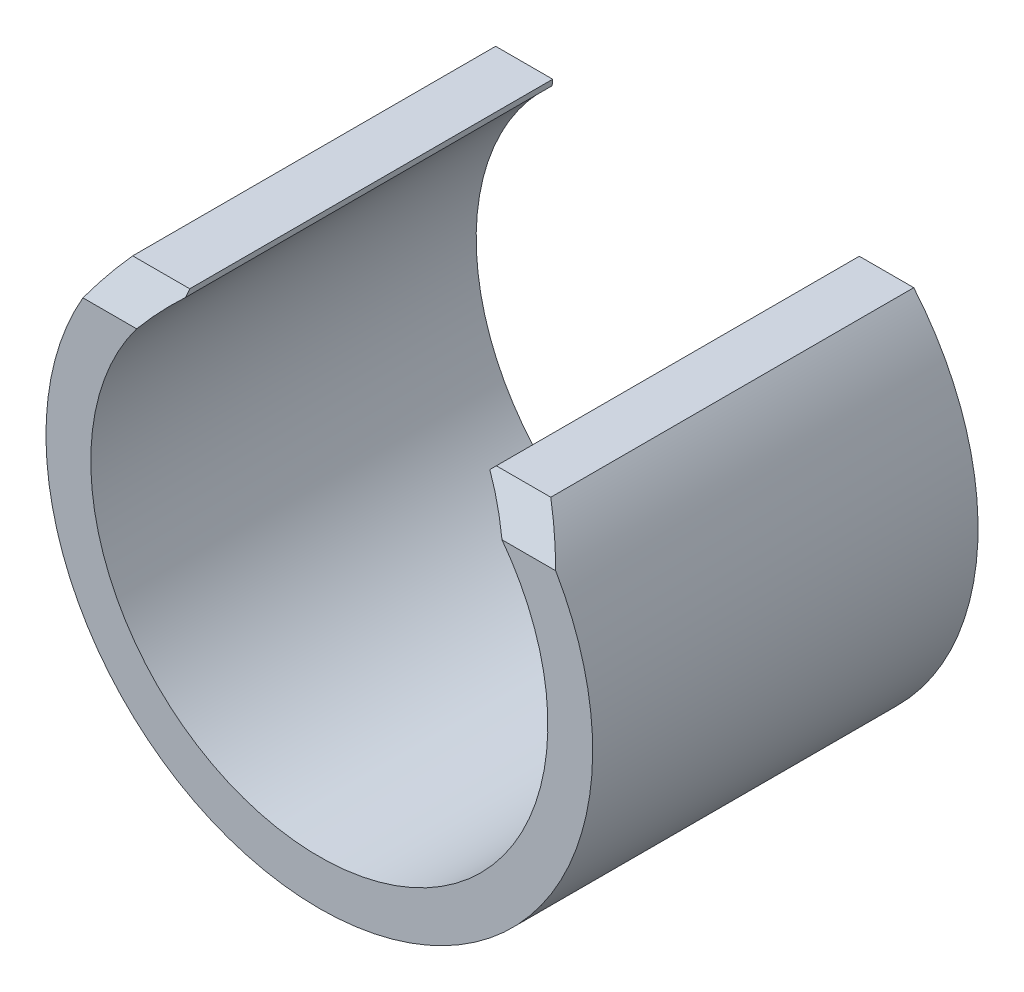
ISO-10303-21;
HEADER;
FILE_DESCRIPTION(('STEP AP214'),'2;1');
FILE_NAME('part.step','',(''),(''),'','','');
FILE_SCHEMA(('AUTOMOTIVE_DESIGN { 1 0 10303 214 1 1 1 1 }'));
ENDSEC;
DATA;
#1=APPLICATION_CONTEXT('core data for automotive mechanical design processes');
#2=APPLICATION_PROTOCOL_DEFINITION('international standard','automotive_design',2000,#1);
#3=PRODUCT_CONTEXT('',#1,'mechanical');
#4=PRODUCT('Part','Part','',(#3));
#5=PRODUCT_RELATED_PRODUCT_CATEGORY('part','',(#4));
#6=PRODUCT_DEFINITION_FORMATION('','',#4);
#7=PRODUCT_DEFINITION_CONTEXT('part definition',#1,'design');
#8=PRODUCT_DEFINITION('design','',#6,#7);
#9=PRODUCT_DEFINITION_SHAPE('','',#8);
#10=(LENGTH_UNIT() NAMED_UNIT(*) SI_UNIT(.MILLI.,.METRE.));
#11=(NAMED_UNIT(*) PLANE_ANGLE_UNIT() SI_UNIT($,.RADIAN.));
#12=(NAMED_UNIT(*) SI_UNIT($,.STERADIAN.) SOLID_ANGLE_UNIT());
#13=UNCERTAINTY_MEASURE_WITH_UNIT(LENGTH_MEASURE(1.E-05),#10,'distance_accuracy_value','');
#14=(GEOMETRIC_REPRESENTATION_CONTEXT(3) GLOBAL_UNCERTAINTY_ASSIGNED_CONTEXT((#13)) GLOBAL_UNIT_ASSIGNED_CONTEXT((#10,
#11,#12)) REPRESENTATION_CONTEXT('',''));
#15=CARTESIAN_POINT('',(0.,0.,0.));
#16=DIRECTION('',(0.,0.,1.));
#17=DIRECTION('',(1.,0.,0.));
#18=AXIS2_PLACEMENT_3D('',#15,#16,#17);
#19=CARTESIAN_POINT('',(-132.090361963931,-120.590013889798,8.6));
#20=DIRECTION('',(0.,0.,-1.));
#21=DIRECTION('',(-1.,0.,0.));
#22=AXIS2_PLACEMENT_3D('',#19,#20,#21);
#23=CYLINDRICAL_SURFACE('',#22,6.1);
#24=DIRECTION('',(0.,0.,-1.));
#25=VECTOR('',#24,1.);
#26=CARTESIAN_POINT('',(-127.425332489212,-116.659683114914,8.6));
#27=LINE('',#26,#25);
#28=CARTESIAN_POINT('',(-127.425332489212,-116.659683114914,8.09999999999999));
#29=VERTEX_POINT('',#28);
#30=CARTESIAN_POINT('',(-127.425332489212,-116.659683114914,0.));
#31=VERTEX_POINT('',#30);
#32=EDGE_CURVE('E100',#29,#31,#27,.T.);
#33=ORIENTED_EDGE('',*,*,#32,.F.);
#34=CARTESIAN_POINT('',(-132.090361963931,-120.590013889798,10.3691775308835));
#35=DIRECTION('',(0.,0.500000000000004,0.866025403784436));
#36=DIRECTION('',(0.,0.866025403784436,-0.500000000000004));
#37=AXIS2_PLACEMENT_3D('',#34,#35,#36);
#38=ELLIPSE('',#37,7.04367328411346,6.1);
#39=CARTESIAN_POINT('',(-126.815892076573,-117.525708518699,8.6));
#40=VERTEX_POINT('',#39);
#41=EDGE_CURVE('E145',#29,#40,#38,.F.);
#42=ORIENTED_EDGE('',*,*,#41,.T.);
#43=CARTESIAN_POINT('',(-132.090361963931,-120.590013889798,8.6));
#44=DIRECTION('',(0.,0.,1.));
#45=DIRECTION('',(1.,0.,0.));
#46=AXIS2_PLACEMENT_3D('',#43,#44,#45);
#47=CIRCLE('',#46,6.1);
#48=CARTESIAN_POINT('',(-137.364831851289,-117.525708518699,8.6));
#49=VERTEX_POINT('',#48);
#50=EDGE_CURVE('E130',#49,#40,#47,.T.);
#51=ORIENTED_EDGE('',*,*,#50,.F.);
#52=CARTESIAN_POINT('',(-132.090361963931,-120.590013889798,10.3691775308835));
#53=DIRECTION('',(0.,0.499999999999995,0.866025403784442));
#54=DIRECTION('',(0.,0.866025403784442,-0.499999999999995));
#55=AXIS2_PLACEMENT_3D('',#52,#53,#54);
#56=ELLIPSE('',#55,7.04367328411341,6.1);
#57=CARTESIAN_POINT('',(-136.75539143865,-116.659683114914,8.09999999999999));
#58=VERTEX_POINT('',#57);
#59=EDGE_CURVE('E143',#49,#58,#56,.F.);
#60=ORIENTED_EDGE('',*,*,#59,.T.);
#61=DIRECTION('',(0.,0.,-1.));
#62=VECTOR('',#61,1.);
#63=CARTESIAN_POINT('',(-136.75539143865,-116.659683114914,8.6));
#64=LINE('',#63,#62);
#65=CARTESIAN_POINT('',(-136.75539143865,-116.659683114914,0.));
#66=VERTEX_POINT('',#65);
#67=EDGE_CURVE('E109',#58,#66,#64,.T.);
#68=ORIENTED_EDGE('',*,*,#67,.T.);
#69=CARTESIAN_POINT('',(-132.090361963931,-120.590013889798,0.));
#70=DIRECTION('',(0.,0.,1.));
#71=DIRECTION('',(1.,0.,0.));
#72=AXIS2_PLACEMENT_3D('',#69,#70,#71);
#73=CIRCLE('',#72,6.1);
#74=EDGE_CURVE('E115',#66,#31,#73,.T.);
#75=ORIENTED_EDGE('',*,*,#74,.T.);
#76=EDGE_LOOP('',(#33,#42,#51,#60,#68,#75));
#77=FACE_BOUND('',#76,.T.);
#78=ADVANCED_FACE('F36',(#77),#23,.T.);
#79=CARTESIAN_POINT('',(-128.840361963931,-116.659683114914,8.6));
#80=DIRECTION('',(0.,-1.,0.));
#81=DIRECTION('',(1.,0.,0.));
#82=AXIS2_PLACEMENT_3D('',#79,#80,#81);
#83=PLANE('',#82);
#84=DIRECTION('',(-1.,0.,0.));
#85=VECTOR('',#84,1.);
#86=CARTESIAN_POINT('',(-128.840361963931,-116.659683114914,0.));
#87=LINE('',#86,#85);
#88=CARTESIAN_POINT('',(-128.640361963931,-116.659683114914,0.));
#89=VERTEX_POINT('',#88);
#90=EDGE_CURVE('E103',#31,#89,#87,.T.);
#91=ORIENTED_EDGE('',*,*,#90,.T.);
#92=DIRECTION('',(0.,0.,1.));
#93=VECTOR('',#92,1.);
#94=CARTESIAN_POINT('',(-128.640361963931,-116.659683114914,8.6));
#95=LINE('',#94,#93);
#96=CARTESIAN_POINT('',(-128.640361963931,-116.659683114914,8.09999999999999));
#97=VERTEX_POINT('',#96);
#98=EDGE_CURVE('E45',#89,#97,#95,.T.);
#99=ORIENTED_EDGE('',*,*,#98,.T.);
#100=DIRECTION('',(1.,0.,0.));
#101=VECTOR('',#100,1.);
#102=CARTESIAN_POINT('',(-127.425332489212,-116.659683114914,8.09999999999999));
#103=LINE('',#102,#101);
#104=EDGE_CURVE('E104',#97,#29,#103,.T.);
#105=ORIENTED_EDGE('',*,*,#104,.T.);
#106=ORIENTED_EDGE('',*,*,#32,.T.);
#107=EDGE_LOOP('',(#91,#99,#105,#106));
#108=FACE_BOUND('',#107,.T.);
#109=ADVANCED_FACE('F102',(#108),#83,.F.);
#110=CARTESIAN_POINT('',(-132.090361963931,-120.590013889798,8.6));
#111=DIRECTION('',(0.,0.,-1.));
#112=DIRECTION('',(-1.,0.,0.));
#113=AXIS2_PLACEMENT_3D('',#110,#111,#112);
#114=CYLINDRICAL_SURFACE('',#113,5.1);
#115=CARTESIAN_POINT('',(-132.090361963931,-120.590013889798,0.));
#116=DIRECTION('',(0.,0.,-1.));
#117=DIRECTION('',(1.,0.,0.));
#118=AXIS2_PLACEMENT_3D('',#115,#116,#117);
#119=CIRCLE('',#118,5.1);
#120=CARTESIAN_POINT('',(-128.732288811938,-116.751609962921,0.));
#121=VERTEX_POINT('',#120);
#122=CARTESIAN_POINT('',(-135.49503751927,-116.792885453351,0.));
#123=VERTEX_POINT('',#122);
#124=EDGE_CURVE('E118',#121,#123,#119,.T.);
#125=ORIENTED_EDGE('',*,*,#124,.T.);
#126=DIRECTION('',(0.,0.,-1.));
#127=VECTOR('',#126,1.);
#128=CARTESIAN_POINT('',(-135.49503751927,-116.792885453351,8.6));
#129=LINE('',#128,#127);
#130=CARTESIAN_POINT('',(-135.49503751927,-116.792885453351,8.17690440595322));
#131=VERTEX_POINT('',#130);
#132=EDGE_CURVE('E59',#123,#131,#129,.F.);
#133=ORIENTED_EDGE('',*,*,#132,.T.);
#134=CARTESIAN_POINT('',(-132.090361963931,-120.590013889798,10.3691775308835));
#135=DIRECTION('',(0.,0.499999999999995,0.866025403784442));
#136=DIRECTION('',(0.,0.866025403784442,-0.499999999999995));
#137=AXIS2_PLACEMENT_3D('',#134,#135,#136);
#138=ELLIPSE('',#137,5.88897274573416,5.1);
#139=CARTESIAN_POINT('',(-136.167129383425,-117.525708518699,8.6));
#140=VERTEX_POINT('',#139);
#141=EDGE_CURVE('E137',#131,#140,#138,.T.);
#142=ORIENTED_EDGE('',*,*,#141,.T.);
#143=CARTESIAN_POINT('',(-132.090361963931,-120.590013889798,8.6));
#144=DIRECTION('',(0.,0.,-1.));
#145=DIRECTION('',(1.,0.,0.));
#146=AXIS2_PLACEMENT_3D('',#143,#144,#145);
#147=CIRCLE('',#146,5.1);
#148=CARTESIAN_POINT('',(-128.013594544437,-117.525708518699,8.6));
#149=VERTEX_POINT('',#148);
#150=EDGE_CURVE('E124',#149,#140,#147,.T.);
#151=ORIENTED_EDGE('',*,*,#150,.F.);
#152=CARTESIAN_POINT('',(-132.090361963931,-120.590013889798,10.3691775308835));
#153=DIRECTION('',(0.,0.500000000000004,0.866025403784436));
#154=DIRECTION('',(0.,0.866025403784436,-0.500000000000004));
#155=AXIS2_PLACEMENT_3D('',#152,#153,#154);
#156=ELLIPSE('',#155,5.8889727457342,5.1);
#157=CARTESIAN_POINT('',(-128.732288811938,-116.751609962921,8.15307399044262));
#158=VERTEX_POINT('',#157);
#159=EDGE_CURVE('E139',#149,#158,#156,.T.);
#160=ORIENTED_EDGE('',*,*,#159,.T.);
#161=DIRECTION('',(0.,0.,-1.));
#162=VECTOR('',#161,1.);
#163=CARTESIAN_POINT('',(-128.732288811938,-116.751609962921,8.6));
#164=LINE('',#163,#162);
#165=EDGE_CURVE('E156',#158,#121,#164,.T.);
#166=ORIENTED_EDGE('',*,*,#165,.T.);
#167=EDGE_LOOP('',(#125,#133,#142,#151,#160,#166));
#168=FACE_BOUND('',#167,.T.);
#169=ADVANCED_FACE('F171',(#168),#114,.F.);
#170=CARTESIAN_POINT('',(-135.340361963931,-116.659683114914,8.6));
#171=DIRECTION('',(0.,-1.,0.));
#172=DIRECTION('',(1.,0.,0.));
#173=AXIS2_PLACEMENT_3D('',#170,#171,#172);
#174=PLANE('',#173);
#175=DIRECTION('',(1.,0.,0.));
#176=VECTOR('',#175,1.);
#177=CARTESIAN_POINT('',(-135.340361963931,-116.659683114914,8.09999999999999));
#178=LINE('',#177,#176);
#179=CARTESIAN_POINT('',(-135.482416700959,-116.659683114914,8.09999999999999));
#180=VERTEX_POINT('',#179);
#181=EDGE_CURVE('E147',#58,#180,#178,.T.);
#182=ORIENTED_EDGE('',*,*,#181,.T.);
#183=DIRECTION('',(0.,0.,-1.));
#184=VECTOR('',#183,1.);
#185=CARTESIAN_POINT('',(-135.482416700959,-116.659683114914,8.6));
#186=LINE('',#185,#184);
#187=CARTESIAN_POINT('',(-135.482416700959,-116.659683114914,0.));
#188=VERTEX_POINT('',#187);
#189=EDGE_CURVE('E150',#180,#188,#186,.T.);
#190=ORIENTED_EDGE('',*,*,#189,.T.);
#191=DIRECTION('',(-1.,0.,0.));
#192=VECTOR('',#191,1.);
#193=CARTESIAN_POINT('',(-135.340361963931,-116.659683114914,0.));
#194=LINE('',#193,#192);
#195=EDGE_CURVE('E128',#188,#66,#194,.T.);
#196=ORIENTED_EDGE('',*,*,#195,.T.);
#197=ORIENTED_EDGE('',*,*,#67,.F.);
#198=EDGE_LOOP('',(#182,#190,#196,#197));
#199=FACE_BOUND('',#198,.T.);
#200=ADVANCED_FACE('F169',(#199),#174,.F.);
#201=CARTESIAN_POINT('',(-132.090361963931,-120.590013889798,8.6));
#202=DIRECTION('',(0.,0.,1.));
#203=DIRECTION('',(1.,0.,0.));
#204=AXIS2_PLACEMENT_3D('',#201,#202,#203);
#205=PLANE('',#204);
#206=ORIENTED_EDGE('',*,*,#50,.T.);
#207=DIRECTION('',(-1.,0.,0.));
#208=VECTOR('',#207,1.);
#209=CARTESIAN_POINT('',(-128.840361963931,-117.525708518699,8.6));
#210=LINE('',#209,#208);
#211=EDGE_CURVE('E134',#40,#149,#210,.T.);
#212=ORIENTED_EDGE('',*,*,#211,.T.);
#213=ORIENTED_EDGE('',*,*,#150,.T.);
#214=DIRECTION('',(-1.,0.,0.));
#215=VECTOR('',#214,1.);
#216=CARTESIAN_POINT('',(-136.75539143865,-117.525708518699,8.6));
#217=LINE('',#216,#215);
#218=EDGE_CURVE('E108',#140,#49,#217,.T.);
#219=ORIENTED_EDGE('',*,*,#218,.T.);
#220=EDGE_LOOP('',(#206,#212,#213,#219));
#221=FACE_BOUND('',#220,.T.);
#222=ADVANCED_FACE('F182',(#221),#205,.T.);
#223=CARTESIAN_POINT('',(-132.090361963931,-120.590013889798,0.));
#224=DIRECTION('',(0.,0.,1.));
#225=DIRECTION('',(1.,0.,0.));
#226=AXIS2_PLACEMENT_3D('',#223,#224,#225);
#227=PLANE('',#226);
#228=ORIENTED_EDGE('',*,*,#195,.F.);
#229=DIRECTION('',(0.0943267655629178,0.995541290604482,0.));
#230=VECTOR('',#229,1.);
#231=CARTESIAN_POINT('',(-135.482416700959,-116.659683114914,0.));
#232=LINE('',#231,#230);
#233=EDGE_CURVE('E154',#188,#123,#232,.F.);
#234=ORIENTED_EDGE('',*,*,#233,.T.);
#235=ORIENTED_EDGE('',*,*,#124,.F.);
#236=DIRECTION('',(-0.707106781186601,-0.707106781186494,0.));
#237=VECTOR('',#236,1.);
#238=CARTESIAN_POINT('',(-128.732288811938,-116.751609962921,0.));
#239=LINE('',#238,#237);
#240=EDGE_CURVE('E117',#121,#89,#239,.F.);
#241=ORIENTED_EDGE('',*,*,#240,.T.);
#242=ORIENTED_EDGE('',*,*,#90,.F.);
#243=ORIENTED_EDGE('',*,*,#74,.F.);
#244=EDGE_LOOP('',(#228,#234,#235,#241,#242,#243));
#245=FACE_BOUND('',#244,.T.);
#246=ADVANCED_FACE('F114',(#245),#227,.F.);
#247=CARTESIAN_POINT('',(-132.090361963931,-117.525708518699,8.6));
#248=DIRECTION('',(0.,0.500000000000004,0.866025403784436));
#249=DIRECTION('',(1.,0.,0.));
#250=AXIS2_PLACEMENT_3D('',#247,#248,#249);
#251=PLANE('',#250);
#252=ORIENTED_EDGE('',*,*,#104,.F.);
#253=DIRECTION('',(0.654653670708033,0.654653670707935,-0.377964473009203));
#254=VECTOR('',#253,1.);
#255=CARTESIAN_POINT('',(-130.613805051808,-118.633126202791,9.23936789801609));
#256=LINE('',#255,#254);
#257=EDGE_CURVE('E11',#97,#158,#256,.F.);
#258=ORIENTED_EDGE('',*,*,#257,.T.);
#259=ORIENTED_EDGE('',*,*,#159,.F.);
#260=ORIENTED_EDGE('',*,*,#211,.F.);
#261=ORIENTED_EDGE('',*,*,#41,.F.);
#262=EDGE_LOOP('',(#252,#258,#259,#260,#261));
#263=FACE_BOUND('',#262,.T.);
#264=ADVANCED_FACE('F177',(#263),#251,.T.);
#265=CARTESIAN_POINT('',(-132.090361963931,-117.525708518699,8.6));
#266=DIRECTION('',(0.,0.499999999999995,0.866025403784442));
#267=DIRECTION('',(1.,0.,0.));
#268=AXIS2_PLACEMENT_3D('',#265,#266,#267);
#269=PLANE('',#268);
#270=ORIENTED_EDGE('',*,*,#141,.F.);
#271=DIRECTION('',(-0.0817803813842012,-0.86312454310806,0.498325187307603));
#272=VECTOR('',#271,1.);
#273=CARTESIAN_POINT('',(-135.541236982215,-117.280482718994,8.45841881852827));
#274=LINE('',#273,#272);
#275=EDGE_CURVE('E160',#131,#180,#274,.F.);
#276=ORIENTED_EDGE('',*,*,#275,.T.);
#277=ORIENTED_EDGE('',*,*,#181,.F.);
#278=ORIENTED_EDGE('',*,*,#59,.F.);
#279=ORIENTED_EDGE('',*,*,#218,.F.);
#280=EDGE_LOOP('',(#270,#276,#277,#278,#279));
#281=FACE_BOUND('',#280,.T.);
#282=ADVANCED_FACE('F164',(#281),#269,.T.);
#283=CARTESIAN_POINT('',(-135.482416700959,-116.659683114914,8.6));
#284=DIRECTION('',(-0.995541290604482,0.0943267655629178,0.));
#285=DIRECTION('',(0.,0.,-1.));
#286=AXIS2_PLACEMENT_3D('',#283,#284,#285);
#287=PLANE('',#286);
#288=ORIENTED_EDGE('',*,*,#275,.F.);
#289=ORIENTED_EDGE('',*,*,#132,.F.);
#290=ORIENTED_EDGE('',*,*,#233,.F.);
#291=ORIENTED_EDGE('',*,*,#189,.F.);
#292=EDGE_LOOP('',(#288,#289,#290,#291));
#293=FACE_BOUND('',#292,.T.);
#294=ADVANCED_FACE('F170',(#293),#287,.F.);
#295=CARTESIAN_POINT('',(-128.732288811938,-116.751609962921,8.6));
#296=DIRECTION('',(0.707106781186494,-0.707106781186601,0.));
#297=DIRECTION('',(0.,0.,-1.));
#298=AXIS2_PLACEMENT_3D('',#295,#296,#297);
#299=PLANE('',#298);
#300=ORIENTED_EDGE('',*,*,#257,.F.);
#301=ORIENTED_EDGE('',*,*,#98,.F.);
#302=ORIENTED_EDGE('',*,*,#240,.F.);
#303=ORIENTED_EDGE('',*,*,#165,.F.);
#304=EDGE_LOOP('',(#300,#301,#302,#303));
#305=FACE_BOUND('',#304,.T.);
#306=ADVANCED_FACE('F39',(#305),#299,.F.);
#307=CLOSED_SHELL('',(#78,#109,#169,#200,#222,#246,#264,#282,#294,#306));
#308=MANIFOLD_SOLID_BREP('B2',#307);
#309=ADVANCED_BREP_SHAPE_REPRESENTATION('',(#18,#308),#14);
#310=SHAPE_DEFINITION_REPRESENTATION(#9,#309);
ENDSEC;
END-ISO-10303-21;
